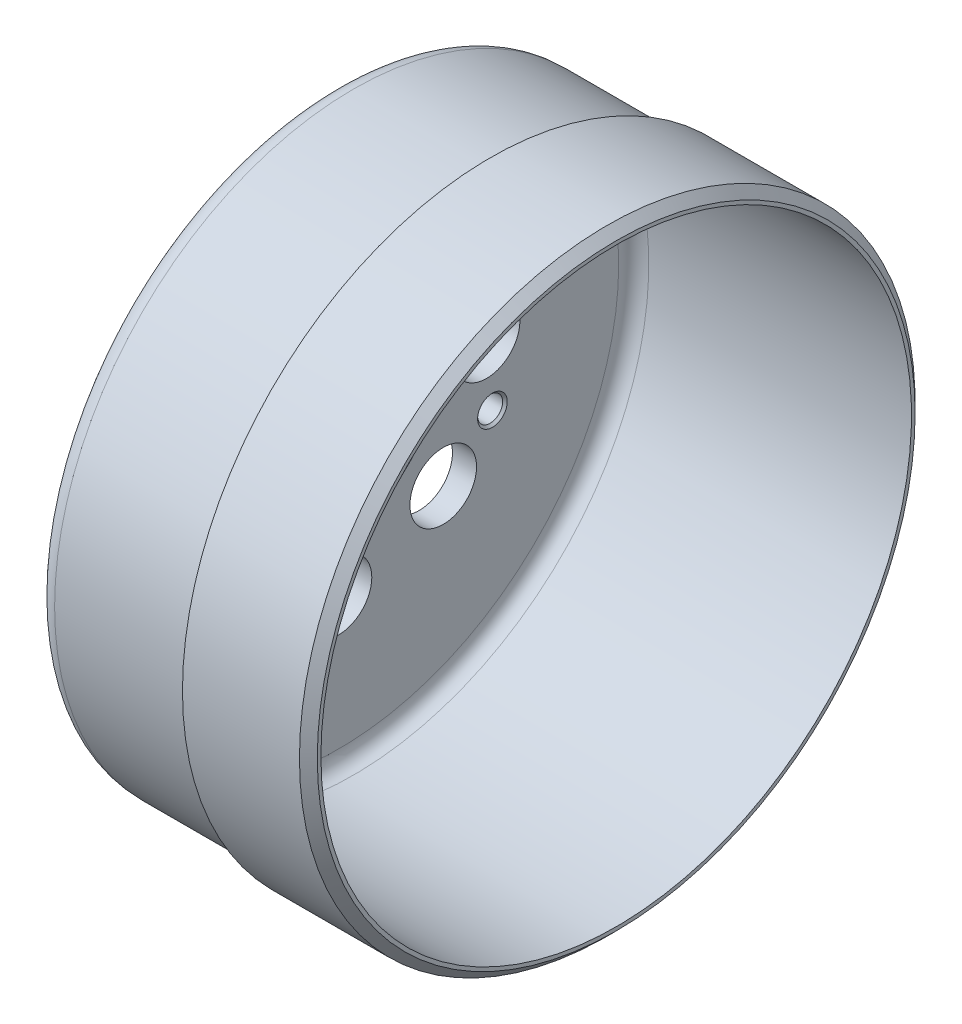
ISO-10303-21;
HEADER;
FILE_DESCRIPTION(('STEP AP214'),'2;1');
FILE_NAME('part.step','',(''),(''),'','','');
FILE_SCHEMA(('AUTOMOTIVE_DESIGN { 1 0 10303 214 1 1 1 1 }'));
ENDSEC;
DATA;
#1=APPLICATION_CONTEXT('core data for automotive mechanical design processes');
#2=APPLICATION_PROTOCOL_DEFINITION('international standard','automotive_design',2000,#1);
#3=PRODUCT_CONTEXT('',#1,'mechanical');
#4=PRODUCT('Part','Part','',(#3));
#5=PRODUCT_RELATED_PRODUCT_CATEGORY('part','',(#4));
#6=PRODUCT_DEFINITION_FORMATION('','',#4);
#7=PRODUCT_DEFINITION_CONTEXT('part definition',#1,'design');
#8=PRODUCT_DEFINITION('design','',#6,#7);
#9=PRODUCT_DEFINITION_SHAPE('','',#8);
#10=(LENGTH_UNIT() NAMED_UNIT(*) SI_UNIT(.MILLI.,.METRE.));
#11=(NAMED_UNIT(*) PLANE_ANGLE_UNIT() SI_UNIT($,.RADIAN.));
#12=(NAMED_UNIT(*) SI_UNIT($,.STERADIAN.) SOLID_ANGLE_UNIT());
#13=UNCERTAINTY_MEASURE_WITH_UNIT(LENGTH_MEASURE(1.E-05),#10,'distance_accuracy_value','');
#14=(GEOMETRIC_REPRESENTATION_CONTEXT(3) GLOBAL_UNCERTAINTY_ASSIGNED_CONTEXT((#13)) GLOBAL_UNIT_ASSIGNED_CONTEXT((#10,
#11,#12)) REPRESENTATION_CONTEXT('',''));
#15=CARTESIAN_POINT('',(0.,0.,0.));
#16=DIRECTION('',(0.,0.,1.));
#17=DIRECTION('',(1.,0.,0.));
#18=AXIS2_PLACEMENT_3D('',#15,#16,#17);
#19=CARTESIAN_POINT('',(5.522,0.,64.166));
#20=DIRECTION('',(-1.,0.,0.));
#21=DIRECTION('',(0.,0.,1.));
#22=AXIS2_PLACEMENT_3D('',#19,#20,#21);
#23=PLANE('',#22);
#24=CARTESIAN_POINT('',(5.522,0.,0.));
#25=DIRECTION('',(-1.,0.,0.));
#26=DIRECTION('',(0.,0.,-1.));
#27=AXIS2_PLACEMENT_3D('',#24,#25,#26);
#28=CIRCLE('',#27,52.65);
#29=CARTESIAN_POINT('',(5.522,0.,52.65));
#30=VERTEX_POINT('',#29);
#31=CARTESIAN_POINT('',(5.522,0.,-52.65));
#32=VERTEX_POINT('',#31);
#33=EDGE_CURVE('E50',#30,#32,#28,.F.);
#34=ORIENTED_EDGE('',*,*,#33,.T.);
#35=CARTESIAN_POINT('',(5.522,0.,0.));
#36=DIRECTION('',(-1.,0.,0.));
#37=DIRECTION('',(0.,0.,1.));
#38=AXIS2_PLACEMENT_3D('',#35,#36,#37);
#39=CIRCLE('',#38,52.65);
#40=EDGE_CURVE('E56',#32,#30,#39,.F.);
#41=ORIENTED_EDGE('',*,*,#40,.T.);
#42=EDGE_LOOP('',(#34,#41));
#43=FACE_BOUND('',#42,.T.);
#44=CARTESIAN_POINT('',(5.52199999999999,0.,0.));
#45=DIRECTION('',(1.,0.,0.));
#46=DIRECTION('',(0.,0.,1.));
#47=AXIS2_PLACEMENT_3D('',#44,#45,#46);
#48=CIRCLE('',#47,75.682);
#49=CARTESIAN_POINT('',(5.52199999999999,0.,75.682));
#50=VERTEX_POINT('',#49);
#51=CARTESIAN_POINT('',(5.52199999999999,0.,-75.682));
#52=VERTEX_POINT('',#51);
#53=EDGE_CURVE('E61',#50,#52,#48,.T.);
#54=ORIENTED_EDGE('',*,*,#53,.F.);
#55=CARTESIAN_POINT('',(5.52199999999999,0.,0.));
#56=DIRECTION('',(1.,0.,0.));
#57=DIRECTION('',(0.,0.,-1.));
#58=AXIS2_PLACEMENT_3D('',#55,#56,#57);
#59=CIRCLE('',#58,75.682);
#60=EDGE_CURVE('E77',#52,#50,#59,.T.);
#61=ORIENTED_EDGE('',*,*,#60,.F.);
#62=EDGE_LOOP('',(#54,#61));
#63=FACE_BOUND('',#62,.T.);
#64=ADVANCED_FACE('F16',(#43,#63),#23,.T.);
#65=CARTESIAN_POINT('',(4.87200000000001,0.,0.));
#66=DIRECTION('',(1.,0.,0.));
#67=DIRECTION('',(0.,0.,-1.));
#68=AXIS2_PLACEMENT_3D('',#65,#66,#67);
#69=TOROIDAL_SURFACE('',#68,52.65,0.649999999999991);
#70=ORIENTED_EDGE('',*,*,#40,.F.);
#71=ORIENTED_EDGE('',*,*,#33,.F.);
#72=EDGE_LOOP('',(#70,#71));
#73=FACE_BOUND('',#72,.T.);
#74=CARTESIAN_POINT('',(4.872,0.,0.));
#75=DIRECTION('',(-1.,0.,0.));
#76=DIRECTION('',(0.,0.,1.));
#77=AXIS2_PLACEMENT_3D('',#74,#75,#76);
#78=CIRCLE('',#77,52.);
#79=CARTESIAN_POINT('',(4.872,0.,52.));
#80=VERTEX_POINT('',#79);
#81=EDGE_CURVE('E106',#80,#80,#78,.T.);
#82=ORIENTED_EDGE('',*,*,#81,.F.);
#83=EDGE_LOOP('',(#82));
#84=FACE_BOUND('',#83,.T.);
#85=ADVANCED_FACE('F54',(#73,#84),#69,.F.);
#86=CARTESIAN_POINT('',(10.563,0.,0.));
#87=DIRECTION('',(1.,0.,0.));
#88=DIRECTION('',(0.,0.,-1.));
#89=AXIS2_PLACEMENT_3D('',#86,#87,#88);
#90=TOROIDAL_SURFACE('',#89,75.682,5.04100000000001);
#91=ORIENTED_EDGE('',*,*,#53,.T.);
#92=ORIENTED_EDGE('',*,*,#60,.T.);
#93=EDGE_LOOP('',(#91,#92));
#94=FACE_BOUND('',#93,.T.);
#95=CARTESIAN_POINT('',(10.563,0.,0.));
#96=DIRECTION('',(-1.,0.,0.));
#97=DIRECTION('',(0.,0.,1.));
#98=AXIS2_PLACEMENT_3D('',#95,#96,#97);
#99=CIRCLE('',#98,80.723);
#100=CARTESIAN_POINT('',(10.563,0.,80.723));
#101=VERTEX_POINT('',#100);
#102=EDGE_CURVE('E103',#101,#101,#99,.F.);
#103=ORIENTED_EDGE('',*,*,#102,.F.);
#104=EDGE_LOOP('',(#103));
#105=FACE_BOUND('',#104,.T.);
#106=ADVANCED_FACE('F83',(#94,#105),#90,.T.);
#107=CARTESIAN_POINT('',(2.686,0.,0.));
#108=DIRECTION('',(-1.,0.,0.));
#109=DIRECTION('',(0.,0.,1.));
#110=AXIS2_PLACEMENT_3D('',#107,#108,#109);
#111=CYLINDRICAL_SURFACE('',#110,52.);
#112=ORIENTED_EDGE('',*,*,#81,.T.);
#113=EDGE_LOOP('',(#112));
#114=FACE_BOUND('',#113,.T.);
#115=CARTESIAN_POINT('',(0.5,0.,0.));
#116=DIRECTION('',(1.,0.,0.));
#117=DIRECTION('',(0.,0.,1.));
#118=AXIS2_PLACEMENT_3D('',#115,#116,#117);
#119=CIRCLE('',#118,52.);
#120=CARTESIAN_POINT('',(0.5,0.,52.));
#121=VERTEX_POINT('',#120);
#122=EDGE_CURVE('E101',#121,#121,#119,.F.);
#123=ORIENTED_EDGE('',*,*,#122,.F.);
#124=EDGE_LOOP('',(#123));
#125=FACE_BOUND('',#124,.T.);
#126=ADVANCED_FACE('F93',(#114,#125),#111,.T.);
#127=CARTESIAN_POINT('',(29.0315,0.,0.));
#128=DIRECTION('',(-1.,0.,0.));
#129=DIRECTION('',(0.,0.,1.));
#130=AXIS2_PLACEMENT_3D('',#127,#128,#129);
#131=CYLINDRICAL_SURFACE('',#130,80.723);
#132=CARTESIAN_POINT('',(47.5,0.,0.));
#133=DIRECTION('',(-1.,0.,0.));
#134=DIRECTION('',(0.,0.,1.));
#135=AXIS2_PLACEMENT_3D('',#132,#133,#134);
#136=CIRCLE('',#135,80.723);
#137=CARTESIAN_POINT('',(47.5,0.,80.723));
#138=VERTEX_POINT('',#137);
#139=EDGE_CURVE('E219',#138,#138,#136,.F.);
#140=ORIENTED_EDGE('',*,*,#139,.F.);
#141=EDGE_LOOP('',(#140));
#142=FACE_BOUND('',#141,.T.);
#143=ORIENTED_EDGE('',*,*,#102,.T.);
#144=EDGE_LOOP('',(#143));
#145=FACE_BOUND('',#144,.T.);
#146=ADVANCED_FACE('F551',(#142,#145),#131,.T.);
#147=CARTESIAN_POINT('',(5.6843418860808E-11,-17.220754456429,-41.5745789630079));
#148=DIRECTION('',(-1.,0.,0.));
#149=DIRECTION('',(0.,0.,1.));
#150=AXIS2_PLACEMENT_3D('',#147,#148,#149);
#151=CONICAL_SURFACE('',#150,3.99999999989792,0.785398163409685);
#152=CARTESIAN_POINT('',(0.625,-17.220754456429,-41.5745789630079));
#153=DIRECTION('',(1.,0.,0.));
#154=DIRECTION('',(0.,0.,-1.));
#155=AXIS2_PLACEMENT_3D('',#152,#153,#154);
#156=CIRCLE('',#155,3.375);
#157=CARTESIAN_POINT('',(0.625,-17.220754456429,-44.9495789630079));
#158=VERTEX_POINT('',#157);
#159=EDGE_CURVE('E217',#158,#158,#156,.T.);
#160=ORIENTED_EDGE('',*,*,#159,.T.);
#161=EDGE_LOOP('',(#160));
#162=FACE_BOUND('',#161,.T.);
#163=CARTESIAN_POINT('',(-2.84208420665793E-11,-17.220754456429,-41.5745789630079));
#164=DIRECTION('',(-1.,0.,0.));
#165=DIRECTION('',(0.,0.,1.));
#166=AXIS2_PLACEMENT_3D('',#163,#164,#165);
#167=CIRCLE('',#166,3.99999999998319);
#168=CARTESIAN_POINT('',(-2.84208420665793E-11,-17.220754456429,-37.5745789630247));
#169=VERTEX_POINT('',#168);
#170=EDGE_CURVE('E216',#169,#169,#167,.F.);
#171=ORIENTED_EDGE('',*,*,#170,.F.);
#172=EDGE_LOOP('',(#171));
#173=FACE_BOUND('',#172,.T.);
#174=ADVANCED_FACE('F541',(#162,#173),#151,.F.);
#175=CARTESIAN_POINT('',(5.6843418860808E-11,17.220754456429,41.5745789630079));
#176=DIRECTION('',(-1.,0.,0.));
#177=DIRECTION('',(0.,0.,1.));
#178=AXIS2_PLACEMENT_3D('',#175,#176,#177);
#179=CONICAL_SURFACE('',#178,3.99999999989792,0.785398163409685);
#180=CARTESIAN_POINT('',(0.625,17.220754456429,41.5745789630079));
#181=DIRECTION('',(1.,0.,0.));
#182=DIRECTION('',(0.,0.,-1.));
#183=AXIS2_PLACEMENT_3D('',#180,#181,#182);
#184=CIRCLE('',#183,3.375);
#185=CARTESIAN_POINT('',(0.625,17.220754456429,38.1995789630079));
#186=VERTEX_POINT('',#185);
#187=EDGE_CURVE('E214',#186,#186,#184,.T.);
#188=ORIENTED_EDGE('',*,*,#187,.T.);
#189=EDGE_LOOP('',(#188));
#190=FACE_BOUND('',#189,.T.);
#191=CARTESIAN_POINT('',(-2.84208420665793E-11,17.220754456429,41.5745789630079));
#192=DIRECTION('',(-1.,0.,0.));
#193=DIRECTION('',(0.,0.,1.));
#194=AXIS2_PLACEMENT_3D('',#191,#192,#193);
#195=CIRCLE('',#194,3.99999999998319);
#196=CARTESIAN_POINT('',(-2.84208420665793E-11,17.220754456429,45.5745789629911));
#197=VERTEX_POINT('',#196);
#198=EDGE_CURVE('E229',#197,#197,#195,.F.);
#199=ORIENTED_EDGE('',*,*,#198,.F.);
#200=EDGE_LOOP('',(#199));
#201=FACE_BOUND('',#200,.T.);
#202=ADVANCED_FACE('F531',(#190,#201),#179,.F.);
#203=CARTESIAN_POINT('',(0.5,0.,0.));
#204=DIRECTION('',(1.,0.,0.));
#205=DIRECTION('',(0.,0.,-1.));
#206=AXIS2_PLACEMENT_3D('',#203,#204,#205);
#207=CONICAL_SURFACE('',#206,52.,0.785398163397448);
#208=ORIENTED_EDGE('',*,*,#122,.T.);
#209=EDGE_LOOP('',(#208));
#210=FACE_BOUND('',#209,.T.);
#211=CARTESIAN_POINT('',(0.,0.,0.));
#212=DIRECTION('',(1.,0.,0.));
#213=DIRECTION('',(0.,0.,-1.));
#214=AXIS2_PLACEMENT_3D('',#211,#212,#213);
#215=CIRCLE('',#214,51.5);
#216=CARTESIAN_POINT('',(0.,0.,-51.5));
#217=VERTEX_POINT('',#216);
#218=EDGE_CURVE('E232',#217,#217,#215,.F.);
#219=ORIENTED_EDGE('',*,*,#218,.F.);
#220=EDGE_LOOP('',(#219));
#221=FACE_BOUND('',#220,.T.);
#222=ADVANCED_FACE('F521',(#210,#221),#207,.T.);
#223=CARTESIAN_POINT('',(0.,0.,0.));
#224=DIRECTION('',(-1.,0.,0.));
#225=DIRECTION('',(0.,0.,1.));
#226=AXIS2_PLACEMENT_3D('',#223,#224,#225);
#227=CONICAL_SURFACE('',#226,26.5,0.785398163397448);
#228=CARTESIAN_POINT('',(0.,0.,0.));
#229=DIRECTION('',(-1.,0.,0.));
#230=DIRECTION('',(0.,0.,1.));
#231=AXIS2_PLACEMENT_3D('',#228,#229,#230);
#232=CIRCLE('',#231,26.5);
#233=CARTESIAN_POINT('',(0.,0.,26.5));
#234=VERTEX_POINT('',#233);
#235=EDGE_CURVE('E213',#234,#234,#232,.F.);
#236=ORIENTED_EDGE('',*,*,#235,.F.);
#237=EDGE_LOOP('',(#236));
#238=FACE_BOUND('',#237,.T.);
#239=CARTESIAN_POINT('',(0.500000000000003,0.,0.));
#240=DIRECTION('',(-1.,0.,0.));
#241=DIRECTION('',(0.,0.,1.));
#242=AXIS2_PLACEMENT_3D('',#239,#240,#241);
#243=CIRCLE('',#242,26.);
#244=CARTESIAN_POINT('',(0.500000000000003,0.,26.));
#245=VERTEX_POINT('',#244);
#246=EDGE_CURVE('E210',#245,#245,#243,.F.);
#247=ORIENTED_EDGE('',*,*,#246,.T.);
#248=EDGE_LOOP('',(#247));
#249=FACE_BOUND('',#248,.T.);
#250=ADVANCED_FACE('F512',(#238,#249),#227,.F.);
#251=CARTESIAN_POINT('',(47.5,0.,81.928));
#252=DIRECTION('',(-1.,0.,0.));
#253=DIRECTION('',(0.,0.,1.));
#254=AXIS2_PLACEMENT_3D('',#251,#252,#253);
#255=PLANE('',#254);
#256=ORIENTED_EDGE('',*,*,#139,.T.);
#257=EDGE_LOOP('',(#256));
#258=FACE_BOUND('',#257,.T.);
#259=CARTESIAN_POINT('',(47.5,0.,0.));
#260=DIRECTION('',(-1.,0.,0.));
#261=DIRECTION('',(0.,0.,1.));
#262=AXIS2_PLACEMENT_3D('',#259,#260,#261);
#263=CIRCLE('',#262,83.133);
#264=CARTESIAN_POINT('',(47.5,0.,83.133));
#265=VERTEX_POINT('',#264);
#266=EDGE_CURVE('E209',#265,#265,#263,.F.);
#267=ORIENTED_EDGE('',*,*,#266,.F.);
#268=EDGE_LOOP('',(#267));
#269=FACE_BOUND('',#268,.T.);
#270=ADVANCED_FACE('F502',(#258,#269),#255,.T.);
#271=CARTESIAN_POINT('',(3.25,-17.220754456429,-41.5745789630079));
#272=DIRECTION('',(1.,0.,0.));
#273=DIRECTION('',(0.,0.,-1.));
#274=AXIS2_PLACEMENT_3D('',#271,#272,#273);
#275=CYLINDRICAL_SURFACE('',#274,3.375);
#276=ORIENTED_EDGE('',*,*,#159,.F.);
#277=EDGE_LOOP('',(#276));
#278=FACE_BOUND('',#277,.T.);
#279=CARTESIAN_POINT('',(5.87500000000318,-17.220754456429,-41.5745789630079));
#280=DIRECTION('',(1.,0.,0.));
#281=DIRECTION('',(0.,0.382683432366093,0.923879532510871));
#282=AXIS2_PLACEMENT_3D('',#279,#280,#281);
#283=CIRCLE('',#282,3.37499999999144);
#284=CARTESIAN_POINT('',(5.87500000000318,-15.9291978721967,-38.4564855407916));
#285=VERTEX_POINT('',#284);
#286=EDGE_CURVE('E206',#285,#285,#283,.T.);
#287=ORIENTED_EDGE('',*,*,#286,.T.);
#288=EDGE_LOOP('',(#287));
#289=FACE_BOUND('',#288,.T.);
#290=ADVANCED_FACE('F492',(#278,#289),#275,.F.);
#291=CARTESIAN_POINT('',(3.25,17.220754456429,41.5745789630079));
#292=DIRECTION('',(1.,0.,0.));
#293=DIRECTION('',(0.,0.,-1.));
#294=AXIS2_PLACEMENT_3D('',#291,#292,#293);
#295=CYLINDRICAL_SURFACE('',#294,3.375);
#296=ORIENTED_EDGE('',*,*,#187,.F.);
#297=EDGE_LOOP('',(#296));
#298=FACE_BOUND('',#297,.T.);
#299=CARTESIAN_POINT('',(5.87500000000318,17.220754456429,41.5745789630079));
#300=DIRECTION('',(1.,0.,0.));
#301=DIRECTION('',(0.,-0.382683432366093,-0.923879532510871));
#302=AXIS2_PLACEMENT_3D('',#299,#300,#301);
#303=CIRCLE('',#302,3.37499999999144);
#304=CARTESIAN_POINT('',(5.87500000000318,15.9291978721967,38.4564855407916));
#305=VERTEX_POINT('',#304);
#306=EDGE_CURVE('E202',#305,#305,#303,.T.);
#307=ORIENTED_EDGE('',*,*,#306,.T.);
#308=EDGE_LOOP('',(#307));
#309=FACE_BOUND('',#308,.T.);
#310=ADVANCED_FACE('F482',(#298,#309),#295,.F.);
#311=CARTESIAN_POINT('',(0.,0.,39.));
#312=DIRECTION('',(-1.,0.,0.));
#313=DIRECTION('',(0.,0.,1.));
#314=AXIS2_PLACEMENT_3D('',#311,#312,#313);
#315=PLANE('',#314);
#316=ORIENTED_EDGE('',*,*,#235,.T.);
#317=EDGE_LOOP('',(#316));
#318=FACE_BOUND('',#317,.T.);
#319=ORIENTED_EDGE('',*,*,#218,.T.);
#320=EDGE_LOOP('',(#319));
#321=FACE_BOUND('',#320,.T.);
#322=CARTESIAN_POINT('',(0.,0.,40.));
#323=DIRECTION('',(1.,0.,0.));
#324=DIRECTION('',(0.,0.,-1.));
#325=AXIS2_PLACEMENT_3D('',#322,#323,#324);
#326=CIRCLE('',#325,9.);
#327=CARTESIAN_POINT('',(0.,0.,31.));
#328=VERTEX_POINT('',#327);
#329=EDGE_CURVE('E201',#328,#328,#326,.T.);
#330=ORIENTED_EDGE('',*,*,#329,.T.);
#331=EDGE_LOOP('',(#330));
#332=FACE_BOUND('',#331,.T.);
#333=CARTESIAN_POINT('',(0.,28.2842712474619,28.2842712474619));
#334=DIRECTION('',(1.,0.,0.));
#335=DIRECTION('',(0.,0.,-1.));
#336=AXIS2_PLACEMENT_3D('',#333,#334,#335);
#337=CIRCLE('',#336,9.);
#338=CARTESIAN_POINT('',(0.,28.2842712474619,19.2842712474619));
#339=VERTEX_POINT('',#338);
#340=EDGE_CURVE('E256',#339,#339,#337,.T.);
#341=ORIENTED_EDGE('',*,*,#340,.T.);
#342=EDGE_LOOP('',(#341));
#343=FACE_BOUND('',#342,.T.);
#344=CARTESIAN_POINT('',(0.,40.,0.));
#345=DIRECTION('',(1.,0.,0.));
#346=DIRECTION('',(0.,0.,-1.));
#347=AXIS2_PLACEMENT_3D('',#344,#345,#346);
#348=CIRCLE('',#347,9.);
#349=CARTESIAN_POINT('',(0.,40.,-9.));
#350=VERTEX_POINT('',#349);
#351=EDGE_CURVE('E253',#350,#350,#348,.T.);
#352=ORIENTED_EDGE('',*,*,#351,.T.);
#353=EDGE_LOOP('',(#352));
#354=FACE_BOUND('',#353,.T.);
#355=CARTESIAN_POINT('',(0.,28.2842712474619,-28.2842712474619));
#356=DIRECTION('',(1.,0.,0.));
#357=DIRECTION('',(0.,0.,-1.));
#358=AXIS2_PLACEMENT_3D('',#355,#356,#357);
#359=CIRCLE('',#358,9.);
#360=CARTESIAN_POINT('',(0.,28.2842712474619,-37.2842712474619));
#361=VERTEX_POINT('',#360);
#362=EDGE_CURVE('E250',#361,#361,#359,.T.);
#363=ORIENTED_EDGE('',*,*,#362,.T.);
#364=EDGE_LOOP('',(#363));
#365=FACE_BOUND('',#364,.T.);
#366=CARTESIAN_POINT('',(0.,0.,-40.));
#367=DIRECTION('',(1.,0.,0.));
#368=DIRECTION('',(0.,0.,-1.));
#369=AXIS2_PLACEMENT_3D('',#366,#367,#368);
#370=CIRCLE('',#369,9.);
#371=CARTESIAN_POINT('',(0.,0.,-49.));
#372=VERTEX_POINT('',#371);
#373=EDGE_CURVE('E247',#372,#372,#370,.T.);
#374=ORIENTED_EDGE('',*,*,#373,.T.);
#375=EDGE_LOOP('',(#374));
#376=FACE_BOUND('',#375,.T.);
#377=CARTESIAN_POINT('',(0.,-28.2842712474619,-28.2842712474619));
#378=DIRECTION('',(1.,0.,0.));
#379=DIRECTION('',(0.,0.,-1.));
#380=AXIS2_PLACEMENT_3D('',#377,#378,#379);
#381=CIRCLE('',#380,9.);
#382=CARTESIAN_POINT('',(0.,-28.2842712474619,-37.2842712474619));
#383=VERTEX_POINT('',#382);
#384=EDGE_CURVE('E244',#383,#383,#381,.T.);
#385=ORIENTED_EDGE('',*,*,#384,.T.);
#386=EDGE_LOOP('',(#385));
#387=FACE_BOUND('',#386,.T.);
#388=CARTESIAN_POINT('',(0.,-40.,0.));
#389=DIRECTION('',(1.,0.,0.));
#390=DIRECTION('',(0.,0.,-1.));
#391=AXIS2_PLACEMENT_3D('',#388,#389,#390);
#392=CIRCLE('',#391,9.);
#393=CARTESIAN_POINT('',(0.,-40.,-9.));
#394=VERTEX_POINT('',#393);
#395=EDGE_CURVE('E241',#394,#394,#392,.T.);
#396=ORIENTED_EDGE('',*,*,#395,.T.);
#397=EDGE_LOOP('',(#396));
#398=FACE_BOUND('',#397,.T.);
#399=CARTESIAN_POINT('',(0.,-28.2842712474619,28.2842712474619));
#400=DIRECTION('',(1.,0.,0.));
#401=DIRECTION('',(0.,0.,-1.));
#402=AXIS2_PLACEMENT_3D('',#399,#400,#401);
#403=CIRCLE('',#402,9.00000000000001);
#404=CARTESIAN_POINT('',(0.,-28.2842712474619,19.2842712474619));
#405=VERTEX_POINT('',#404);
#406=EDGE_CURVE('E205',#405,#405,#403,.T.);
#407=ORIENTED_EDGE('',*,*,#406,.T.);
#408=EDGE_LOOP('',(#407));
#409=FACE_BOUND('',#408,.T.);
#410=ORIENTED_EDGE('',*,*,#198,.T.);
#411=EDGE_LOOP('',(#410));
#412=FACE_BOUND('',#411,.T.);
#413=ORIENTED_EDGE('',*,*,#170,.T.);
#414=EDGE_LOOP('',(#413));
#415=FACE_BOUND('',#414,.T.);
#416=ADVANCED_FACE('F472',(#318,#321,#332,#343,#354,#365,#376,#387,#398,#409,#412,#415),#315,.T.);
#417=CARTESIAN_POINT('',(3.25,0.,0.));
#418=DIRECTION('',(-1.,0.,0.));
#419=DIRECTION('',(0.,0.,1.));
#420=AXIS2_PLACEMENT_3D('',#417,#418,#419);
#421=CYLINDRICAL_SURFACE('',#420,26.);
#422=ORIENTED_EDGE('',*,*,#246,.F.);
#423=EDGE_LOOP('',(#422));
#424=FACE_BOUND('',#423,.T.);
#425=CARTESIAN_POINT('',(6.,0.,0.));
#426=DIRECTION('',(1.,0.,0.));
#427=DIRECTION('',(0.,0.,1.));
#428=AXIS2_PLACEMENT_3D('',#425,#426,#427);
#429=CIRCLE('',#428,26.);
#430=CARTESIAN_POINT('',(6.,0.,26.));
#431=VERTEX_POINT('',#430);
#432=EDGE_CURVE('E198',#431,#431,#429,.T.);
#433=ORIENTED_EDGE('',*,*,#432,.T.);
#434=EDGE_LOOP('',(#433));
#435=FACE_BOUND('',#434,.T.);
#436=ADVANCED_FACE('F343',(#424,#435),#421,.F.);
#437=CARTESIAN_POINT('',(63.295,0.,0.));
#438=DIRECTION('',(-1.,0.,0.));
#439=DIRECTION('',(0.,0.,1.));
#440=AXIS2_PLACEMENT_3D('',#437,#438,#439);
#441=CYLINDRICAL_SURFACE('',#440,83.133);
#442=CARTESIAN_POINT('',(79.09,0.,0.));
#443=DIRECTION('',(-1.,0.,0.));
#444=DIRECTION('',(0.,0.,1.));
#445=AXIS2_PLACEMENT_3D('',#442,#443,#444);
#446=CIRCLE('',#445,83.133);
#447=CARTESIAN_POINT('',(79.09,0.,83.133));
#448=VERTEX_POINT('',#447);
#449=EDGE_CURVE('E194',#448,#448,#446,.F.);
#450=ORIENTED_EDGE('',*,*,#449,.F.);
#451=EDGE_LOOP('',(#450));
#452=FACE_BOUND('',#451,.T.);
#453=ORIENTED_EDGE('',*,*,#266,.T.);
#454=EDGE_LOOP('',(#453));
#455=FACE_BOUND('',#454,.T.);
#456=ADVANCED_FACE('F332',(#452,#455),#441,.T.);
#457=CARTESIAN_POINT('',(6.4999999998463,-17.220754456429,-41.5745789630079));
#458=DIRECTION('',(1.,0.,0.));
#459=DIRECTION('',(0.,1.,0.));
#460=AXIS2_PLACEMENT_3D('',#457,#458,#459);
#461=CONICAL_SURFACE('',#460,3.99999999983453,0.785398163444681);
#462=ORIENTED_EDGE('',*,*,#286,.F.);
#463=EDGE_LOOP('',(#462));
#464=FACE_BOUND('',#463,.T.);
#465=CARTESIAN_POINT('',(6.49999999994244,-17.220754456429,-41.5745789630079));
#466=DIRECTION('',(1.,0.,0.));
#467=DIRECTION('',(0.,1.,0.));
#468=AXIS2_PLACEMENT_3D('',#465,#466,#467);
#469=CIRCLE('',#468,3.99999999993067);
#470=CARTESIAN_POINT('',(6.49999999994244,-13.2207544564983,-41.5745789630079));
#471=VERTEX_POINT('',#470);
#472=EDGE_CURVE('E197',#471,#471,#469,.F.);
#473=ORIENTED_EDGE('',*,*,#472,.F.);
#474=EDGE_LOOP('',(#473));
#475=FACE_BOUND('',#474,.T.);
#476=ADVANCED_FACE('F329',(#464,#475),#461,.F.);
#477=CARTESIAN_POINT('',(6.4999999998463,17.220754456429,41.5745789630079));
#478=DIRECTION('',(1.,0.,0.));
#479=DIRECTION('',(0.,1.,0.));
#480=AXIS2_PLACEMENT_3D('',#477,#478,#479);
#481=CONICAL_SURFACE('',#480,3.99999999983453,0.785398163444681);
#482=ORIENTED_EDGE('',*,*,#306,.F.);
#483=EDGE_LOOP('',(#482));
#484=FACE_BOUND('',#483,.T.);
#485=CARTESIAN_POINT('',(6.49999999994244,17.220754456429,41.5745789630079));
#486=DIRECTION('',(1.,0.,0.));
#487=DIRECTION('',(0.,1.,0.));
#488=AXIS2_PLACEMENT_3D('',#485,#486,#487);
#489=CIRCLE('',#488,3.99999999993067);
#490=CARTESIAN_POINT('',(6.49999999994244,21.2207544563597,41.5745789630079));
#491=VERTEX_POINT('',#490);
#492=EDGE_CURVE('E263',#491,#491,#489,.F.);
#493=ORIENTED_EDGE('',*,*,#492,.F.);
#494=EDGE_LOOP('',(#493));
#495=FACE_BOUND('',#494,.T.);
#496=ADVANCED_FACE('F331',(#484,#495),#481,.F.);
#497=CARTESIAN_POINT('',(3.25,-28.2842712474619,28.2842712474619));
#498=DIRECTION('',(1.,0.,0.));
#499=DIRECTION('',(0.,0.,-1.));
#500=AXIS2_PLACEMENT_3D('',#497,#498,#499);
#501=CYLINDRICAL_SURFACE('',#500,9.00000000000001);
#502=CARTESIAN_POINT('',(6.50000000000001,-28.2842712474619,28.2842712474619));
#503=DIRECTION('',(1.,0.,0.));
#504=DIRECTION('',(0.,0.,-1.));
#505=AXIS2_PLACEMENT_3D('',#502,#503,#504);
#506=CIRCLE('',#505,9.00000000000001);
#507=CARTESIAN_POINT('',(6.50000000000001,-28.2842712474619,19.2842712474619));
#508=VERTEX_POINT('',#507);
#509=EDGE_CURVE('E266',#508,#508,#506,.F.);
#510=ORIENTED_EDGE('',*,*,#509,.F.);
#511=EDGE_LOOP('',(#510));
#512=FACE_BOUND('',#511,.T.);
#513=ORIENTED_EDGE('',*,*,#406,.F.);
#514=EDGE_LOOP('',(#513));
#515=FACE_BOUND('',#514,.T.);
#516=ADVANCED_FACE('F340',(#512,#515),#501,.F.);
#517=CARTESIAN_POINT('',(3.25,-40.,0.));
#518=DIRECTION('',(1.,0.,0.));
#519=DIRECTION('',(0.,0.,-1.));
#520=AXIS2_PLACEMENT_3D('',#517,#518,#519);
#521=CYLINDRICAL_SURFACE('',#520,9.);
#522=CARTESIAN_POINT('',(6.5,-40.,0.));
#523=DIRECTION('',(1.,0.,0.));
#524=DIRECTION('',(0.,0.,-1.));
#525=AXIS2_PLACEMENT_3D('',#522,#523,#524);
#526=CIRCLE('',#525,9.);
#527=CARTESIAN_POINT('',(6.5,-40.,-9.));
#528=VERTEX_POINT('',#527);
#529=EDGE_CURVE('E269',#528,#528,#526,.F.);
#530=ORIENTED_EDGE('',*,*,#529,.F.);
#531=EDGE_LOOP('',(#530));
#532=FACE_BOUND('',#531,.T.);
#533=ORIENTED_EDGE('',*,*,#395,.F.);
#534=EDGE_LOOP('',(#533));
#535=FACE_BOUND('',#534,.T.);
#536=ADVANCED_FACE('F430',(#532,#535),#521,.F.);
#537=CARTESIAN_POINT('',(3.25,-28.2842712474619,-28.2842712474619));
#538=DIRECTION('',(1.,0.,0.));
#539=DIRECTION('',(0.,0.,-1.));
#540=AXIS2_PLACEMENT_3D('',#537,#538,#539);
#541=CYLINDRICAL_SURFACE('',#540,9.);
#542=CARTESIAN_POINT('',(6.5,-28.2842712474619,-28.2842712474619));
#543=DIRECTION('',(1.,0.,0.));
#544=DIRECTION('',(0.,0.,-1.));
#545=AXIS2_PLACEMENT_3D('',#542,#543,#544);
#546=CIRCLE('',#545,9.);
#547=CARTESIAN_POINT('',(6.5,-28.2842712474619,-37.2842712474619));
#548=VERTEX_POINT('',#547);
#549=EDGE_CURVE('E272',#548,#548,#546,.F.);
#550=ORIENTED_EDGE('',*,*,#549,.F.);
#551=EDGE_LOOP('',(#550));
#552=FACE_BOUND('',#551,.T.);
#553=ORIENTED_EDGE('',*,*,#384,.F.);
#554=EDGE_LOOP('',(#553));
#555=FACE_BOUND('',#554,.T.);
#556=ADVANCED_FACE('F422',(#552,#555),#541,.F.);
#557=CARTESIAN_POINT('',(3.25,0.,-40.));
#558=DIRECTION('',(1.,0.,0.));
#559=DIRECTION('',(0.,0.,-1.));
#560=AXIS2_PLACEMENT_3D('',#557,#558,#559);
#561=CYLINDRICAL_SURFACE('',#560,9.);
#562=CARTESIAN_POINT('',(6.5,0.,-40.));
#563=DIRECTION('',(1.,0.,0.));
#564=DIRECTION('',(0.,0.,-1.));
#565=AXIS2_PLACEMENT_3D('',#562,#563,#564);
#566=CIRCLE('',#565,9.);
#567=CARTESIAN_POINT('',(6.5,0.,-49.));
#568=VERTEX_POINT('',#567);
#569=EDGE_CURVE('E275',#568,#568,#566,.F.);
#570=ORIENTED_EDGE('',*,*,#569,.F.);
#571=EDGE_LOOP('',(#570));
#572=FACE_BOUND('',#571,.T.);
#573=ORIENTED_EDGE('',*,*,#373,.F.);
#574=EDGE_LOOP('',(#573));
#575=FACE_BOUND('',#574,.T.);
#576=ADVANCED_FACE('F414',(#572,#575),#561,.F.);
#577=CARTESIAN_POINT('',(3.25,28.2842712474619,-28.2842712474619));
#578=DIRECTION('',(1.,0.,0.));
#579=DIRECTION('',(0.,0.,-1.));
#580=AXIS2_PLACEMENT_3D('',#577,#578,#579);
#581=CYLINDRICAL_SURFACE('',#580,9.);
#582=CARTESIAN_POINT('',(6.5,28.2842712474619,-28.2842712474619));
#583=DIRECTION('',(1.,0.,0.));
#584=DIRECTION('',(0.,0.,-1.));
#585=AXIS2_PLACEMENT_3D('',#582,#583,#584);
#586=CIRCLE('',#585,9.);
#587=CARTESIAN_POINT('',(6.5,28.2842712474619,-37.2842712474619));
#588=VERTEX_POINT('',#587);
#589=EDGE_CURVE('E278',#588,#588,#586,.F.);
#590=ORIENTED_EDGE('',*,*,#589,.F.);
#591=EDGE_LOOP('',(#590));
#592=FACE_BOUND('',#591,.T.);
#593=ORIENTED_EDGE('',*,*,#362,.F.);
#594=EDGE_LOOP('',(#593));
#595=FACE_BOUND('',#594,.T.);
#596=ADVANCED_FACE('F406',(#592,#595),#581,.F.);
#597=CARTESIAN_POINT('',(3.25,40.,0.));
#598=DIRECTION('',(1.,0.,0.));
#599=DIRECTION('',(0.,0.,-1.));
#600=AXIS2_PLACEMENT_3D('',#597,#598,#599);
#601=CYLINDRICAL_SURFACE('',#600,9.);
#602=CARTESIAN_POINT('',(6.5,40.,0.));
#603=DIRECTION('',(1.,0.,0.));
#604=DIRECTION('',(0.,0.,-1.));
#605=AXIS2_PLACEMENT_3D('',#602,#603,#604);
#606=CIRCLE('',#605,9.);
#607=CARTESIAN_POINT('',(6.5,40.,-9.));
#608=VERTEX_POINT('',#607);
#609=EDGE_CURVE('E281',#608,#608,#606,.F.);
#610=ORIENTED_EDGE('',*,*,#609,.F.);
#611=EDGE_LOOP('',(#610));
#612=FACE_BOUND('',#611,.T.);
#613=ORIENTED_EDGE('',*,*,#351,.F.);
#614=EDGE_LOOP('',(#613));
#615=FACE_BOUND('',#614,.T.);
#616=ADVANCED_FACE('F398',(#612,#615),#601,.F.);
#617=CARTESIAN_POINT('',(3.25,28.2842712474619,28.2842712474619));
#618=DIRECTION('',(1.,0.,0.));
#619=DIRECTION('',(0.,0.,-1.));
#620=AXIS2_PLACEMENT_3D('',#617,#618,#619);
#621=CYLINDRICAL_SURFACE('',#620,9.);
#622=CARTESIAN_POINT('',(6.5,28.2842712474619,28.2842712474619));
#623=DIRECTION('',(1.,0.,0.));
#624=DIRECTION('',(0.,0.,-1.));
#625=AXIS2_PLACEMENT_3D('',#622,#623,#624);
#626=CIRCLE('',#625,9.);
#627=CARTESIAN_POINT('',(6.5,28.2842712474619,19.2842712474619));
#628=VERTEX_POINT('',#627);
#629=EDGE_CURVE('E284',#628,#628,#626,.F.);
#630=ORIENTED_EDGE('',*,*,#629,.F.);
#631=EDGE_LOOP('',(#630));
#632=FACE_BOUND('',#631,.T.);
#633=ORIENTED_EDGE('',*,*,#340,.F.);
#634=EDGE_LOOP('',(#633));
#635=FACE_BOUND('',#634,.T.);
#636=ADVANCED_FACE('F390',(#632,#635),#621,.F.);
#637=CARTESIAN_POINT('',(3.25,0.,40.));
#638=DIRECTION('',(1.,0.,0.));
#639=DIRECTION('',(0.,0.,-1.));
#640=AXIS2_PLACEMENT_3D('',#637,#638,#639);
#641=CYLINDRICAL_SURFACE('',#640,9.);
#642=CARTESIAN_POINT('',(6.5,0.,40.));
#643=DIRECTION('',(1.,0.,0.));
#644=DIRECTION('',(0.,0.,-1.));
#645=AXIS2_PLACEMENT_3D('',#642,#643,#644);
#646=CIRCLE('',#645,9.);
#647=CARTESIAN_POINT('',(6.5,0.,31.));
#648=VERTEX_POINT('',#647);
#649=EDGE_CURVE('E287',#648,#648,#646,.F.);
#650=ORIENTED_EDGE('',*,*,#649,.F.);
#651=EDGE_LOOP('',(#650));
#652=FACE_BOUND('',#651,.T.);
#653=ORIENTED_EDGE('',*,*,#329,.F.);
#654=EDGE_LOOP('',(#653));
#655=FACE_BOUND('',#654,.T.);
#656=ADVANCED_FACE('F383',(#652,#655),#641,.F.);
#657=CARTESIAN_POINT('',(6.5,0.,0.));
#658=DIRECTION('',(1.,0.,0.));
#659=DIRECTION('',(0.,0.,-1.));
#660=AXIS2_PLACEMENT_3D('',#657,#658,#659);
#661=CONICAL_SURFACE('',#660,26.5,0.785398163397447);
#662=ORIENTED_EDGE('',*,*,#432,.F.);
#663=EDGE_LOOP('',(#662));
#664=FACE_BOUND('',#663,.T.);
#665=CARTESIAN_POINT('',(6.5,0.,0.));
#666=DIRECTION('',(1.,0.,0.));
#667=DIRECTION('',(0.,0.,-1.));
#668=AXIS2_PLACEMENT_3D('',#665,#666,#667);
#669=CIRCLE('',#668,26.5);
#670=CARTESIAN_POINT('',(6.5,0.,-26.5));
#671=VERTEX_POINT('',#670);
#672=EDGE_CURVE('E290',#671,#671,#669,.F.);
#673=ORIENTED_EDGE('',*,*,#672,.F.);
#674=EDGE_LOOP('',(#673));
#675=FACE_BOUND('',#674,.T.);
#676=ADVANCED_FACE('F376',(#664,#675),#661,.F.);
#677=CARTESIAN_POINT('',(79.09,0.,0.));
#678=DIRECTION('',(-1.,0.,0.));
#679=DIRECTION('',(0.,0.,1.));
#680=AXIS2_PLACEMENT_3D('',#677,#678,#679);
#681=CONICAL_SURFACE('',#680,83.133,0.785398163397448);
#682=CARTESIAN_POINT('',(81.5,0.,0.));
#683=DIRECTION('',(-1.,0.,0.));
#684=DIRECTION('',(0.,0.,1.));
#685=AXIS2_PLACEMENT_3D('',#682,#683,#684);
#686=CIRCLE('',#685,80.723);
#687=CARTESIAN_POINT('',(81.5,0.,80.723));
#688=VERTEX_POINT('',#687);
#689=EDGE_CURVE('E293',#688,#688,#686,.F.);
#690=ORIENTED_EDGE('',*,*,#689,.F.);
#691=EDGE_LOOP('',(#690));
#692=FACE_BOUND('',#691,.T.);
#693=ORIENTED_EDGE('',*,*,#449,.T.);
#694=EDGE_LOOP('',(#693));
#695=FACE_BOUND('',#694,.T.);
#696=ADVANCED_FACE('F174',(#692,#695),#681,.T.);
#697=CARTESIAN_POINT('',(6.5,0.,51.091));
#698=DIRECTION('',(1.,0.,0.));
#699=DIRECTION('',(0.,0.,-1.));
#700=AXIS2_PLACEMENT_3D('',#697,#698,#699);
#701=PLANE('',#700);
#702=CARTESIAN_POINT('',(6.49999999999997,0.,0.));
#703=DIRECTION('',(-1.,0.,0.));
#704=DIRECTION('',(0.,0.,-1.));
#705=AXIS2_PLACEMENT_3D('',#702,#703,#704);
#706=CIRCLE('',#705,75.682);
#707=CARTESIAN_POINT('',(6.49999999999998,0.,75.682));
#708=VERTEX_POINT('',#707);
#709=CARTESIAN_POINT('',(6.49999999999999,0.,-75.682));
#710=VERTEX_POINT('',#709);
#711=EDGE_CURVE('E35',#708,#710,#706,.F.);
#712=ORIENTED_EDGE('',*,*,#711,.T.);
#713=CARTESIAN_POINT('',(6.49999999999997,0.,0.));
#714=DIRECTION('',(-1.,0.,0.));
#715=DIRECTION('',(0.,0.,1.));
#716=AXIS2_PLACEMENT_3D('',#713,#714,#715);
#717=CIRCLE('',#716,75.682);
#718=EDGE_CURVE('E185',#710,#708,#717,.F.);
#719=ORIENTED_EDGE('',*,*,#718,.T.);
#720=EDGE_LOOP('',(#712,#719));
#721=FACE_BOUND('',#720,.T.);
#722=ORIENTED_EDGE('',*,*,#672,.T.);
#723=EDGE_LOOP('',(#722));
#724=FACE_BOUND('',#723,.T.);
#725=ORIENTED_EDGE('',*,*,#649,.T.);
#726=EDGE_LOOP('',(#725));
#727=FACE_BOUND('',#726,.T.);
#728=ORIENTED_EDGE('',*,*,#629,.T.);
#729=EDGE_LOOP('',(#728));
#730=FACE_BOUND('',#729,.T.);
#731=ORIENTED_EDGE('',*,*,#609,.T.);
#732=EDGE_LOOP('',(#731));
#733=FACE_BOUND('',#732,.T.);
#734=ORIENTED_EDGE('',*,*,#589,.T.);
#735=EDGE_LOOP('',(#734));
#736=FACE_BOUND('',#735,.T.);
#737=ORIENTED_EDGE('',*,*,#569,.T.);
#738=EDGE_LOOP('',(#737));
#739=FACE_BOUND('',#738,.T.);
#740=ORIENTED_EDGE('',*,*,#549,.T.);
#741=EDGE_LOOP('',(#740));
#742=FACE_BOUND('',#741,.T.);
#743=ORIENTED_EDGE('',*,*,#529,.T.);
#744=EDGE_LOOP('',(#743));
#745=FACE_BOUND('',#744,.T.);
#746=ORIENTED_EDGE('',*,*,#509,.T.);
#747=EDGE_LOOP('',(#746));
#748=FACE_BOUND('',#747,.T.);
#749=ORIENTED_EDGE('',*,*,#492,.T.);
#750=EDGE_LOOP('',(#749));
#751=FACE_BOUND('',#750,.T.);
#752=ORIENTED_EDGE('',*,*,#472,.T.);
#753=EDGE_LOOP('',(#752));
#754=FACE_BOUND('',#753,.T.);
#755=ADVANCED_FACE('F165',(#721,#724,#727,#730,#733,#736,#739,#742,#745,#748,#751,#754),#701,.T.);
#756=CARTESIAN_POINT('',(81.5,0.,80.234));
#757=DIRECTION('',(1.,0.,0.));
#758=DIRECTION('',(0.,0.,-1.));
#759=AXIS2_PLACEMENT_3D('',#756,#757,#758);
#760=PLANE('',#759);
#761=ORIENTED_EDGE('',*,*,#689,.T.);
#762=EDGE_LOOP('',(#761));
#763=FACE_BOUND('',#762,.T.);
#764=CARTESIAN_POINT('',(81.5,0.,0.));
#765=DIRECTION('',(-1.,0.,0.));
#766=DIRECTION('',(0.,0.,1.));
#767=AXIS2_PLACEMENT_3D('',#764,#765,#766);
#768=CIRCLE('',#767,79.745);
#769=CARTESIAN_POINT('',(81.5,0.,79.745));
#770=VERTEX_POINT('',#769);
#771=EDGE_CURVE('E27',#770,#770,#768,.T.);
#772=ORIENTED_EDGE('',*,*,#771,.T.);
#773=EDGE_LOOP('',(#772));
#774=FACE_BOUND('',#773,.T.);
#775=ADVANCED_FACE('F153',(#763,#774),#760,.T.);
#776=CARTESIAN_POINT('',(10.563,0.,0.));
#777=DIRECTION('',(1.,0.,0.));
#778=DIRECTION('',(0.,0.,-1.));
#779=AXIS2_PLACEMENT_3D('',#776,#777,#778);
#780=TOROIDAL_SURFACE('',#779,75.682,4.06300000000003);
#781=ORIENTED_EDGE('',*,*,#718,.F.);
#782=ORIENTED_EDGE('',*,*,#711,.F.);
#783=EDGE_LOOP('',(#781,#782));
#784=FACE_BOUND('',#783,.T.);
#785=CARTESIAN_POINT('',(10.563,0.,0.));
#786=DIRECTION('',(-1.,0.,0.));
#787=DIRECTION('',(0.,0.,1.));
#788=AXIS2_PLACEMENT_3D('',#785,#786,#787);
#789=CIRCLE('',#788,79.745);
#790=CARTESIAN_POINT('',(10.563,0.,79.745));
#791=VERTEX_POINT('',#790);
#792=EDGE_CURVE('E10',#791,#791,#789,.F.);
#793=ORIENTED_EDGE('',*,*,#792,.T.);
#794=EDGE_LOOP('',(#793));
#795=FACE_BOUND('',#794,.T.);
#796=ADVANCED_FACE('F141',(#784,#795),#780,.F.);
#797=CARTESIAN_POINT('',(46.0315,0.,0.));
#798=DIRECTION('',(-1.,0.,0.));
#799=DIRECTION('',(0.,0.,1.));
#800=AXIS2_PLACEMENT_3D('',#797,#798,#799);
#801=CYLINDRICAL_SURFACE('',#800,79.745);
#802=ORIENTED_EDGE('',*,*,#792,.F.);
#803=EDGE_LOOP('',(#802));
#804=FACE_BOUND('',#803,.T.);
#805=ORIENTED_EDGE('',*,*,#771,.F.);
#806=EDGE_LOOP('',(#805));
#807=FACE_BOUND('',#806,.T.);
#808=ADVANCED_FACE('F152',(#804,#807),#801,.F.);
#809=CLOSED_SHELL('',(#64,#85,#106,#126,#146,#174,#202,#222,#250,#270,#290,#310,#416,#436,#456,
#476,#496,#516,#536,#556,#576,#596,#616,#636,#656,#676,#696,#755,#775,#796,#808));
#810=MANIFOLD_SOLID_BREP('B1',#809);
#811=ADVANCED_BREP_SHAPE_REPRESENTATION('',(#18,#810),#14);
#812=SHAPE_DEFINITION_REPRESENTATION(#9,#811);
ENDSEC;
END-ISO-10303-21;
